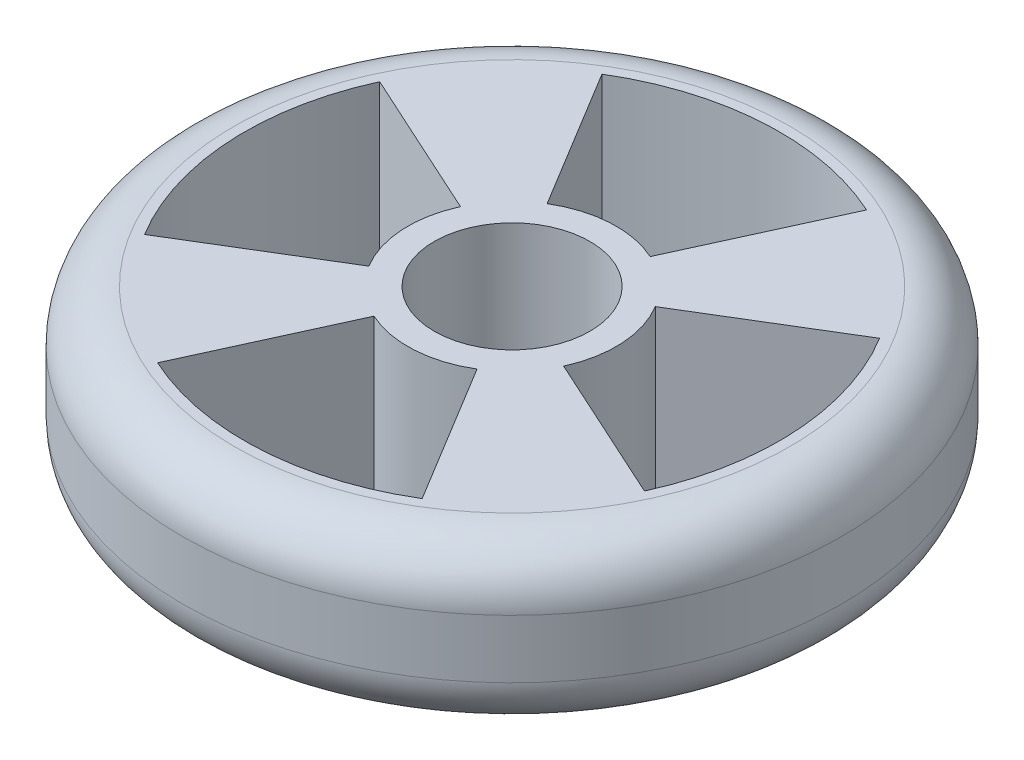
ISO-10303-21;
HEADER;
FILE_DESCRIPTION(('STEP AP214'),'2;1');
FILE_NAME('part.step','',(''),(''),'','','');
FILE_SCHEMA(('AUTOMOTIVE_DESIGN { 1 0 10303 214 1 1 1 1 }'));
ENDSEC;
DATA;
#1=APPLICATION_CONTEXT('core data for automotive mechanical design processes');
#2=APPLICATION_PROTOCOL_DEFINITION('international standard','automotive_design',2000,#1);
#3=PRODUCT_CONTEXT('',#1,'mechanical');
#4=PRODUCT('Part','Part','',(#3));
#5=PRODUCT_RELATED_PRODUCT_CATEGORY('part','',(#4));
#6=PRODUCT_DEFINITION_FORMATION('','',#4);
#7=PRODUCT_DEFINITION_CONTEXT('part definition',#1,'design');
#8=PRODUCT_DEFINITION('design','',#6,#7);
#9=PRODUCT_DEFINITION_SHAPE('','',#8);
#10=(LENGTH_UNIT() NAMED_UNIT(*) SI_UNIT(.MILLI.,.METRE.));
#11=(NAMED_UNIT(*) PLANE_ANGLE_UNIT() SI_UNIT($,.RADIAN.));
#12=(NAMED_UNIT(*) SI_UNIT($,.STERADIAN.) SOLID_ANGLE_UNIT());
#13=UNCERTAINTY_MEASURE_WITH_UNIT(LENGTH_MEASURE(1.E-05),#10,'distance_accuracy_value','');
#14=(GEOMETRIC_REPRESENTATION_CONTEXT(3) GLOBAL_UNCERTAINTY_ASSIGNED_CONTEXT((#13)) GLOBAL_UNIT_ASSIGNED_CONTEXT((#10,
#11,#12)) REPRESENTATION_CONTEXT('',''));
#15=CARTESIAN_POINT('',(0.,0.,0.));
#16=DIRECTION('',(0.,0.,1.));
#17=DIRECTION('',(1.,0.,0.));
#18=AXIS2_PLACEMENT_3D('',#15,#16,#17);
#19=CARTESIAN_POINT('',(0.,25.,-8.));
#20=DIRECTION('',(0.,-1.,0.));
#21=DIRECTION('',(0.,0.,-1.));
#22=AXIS2_PLACEMENT_3D('',#19,#20,#21);
#23=CYLINDRICAL_SURFACE('',#22,1.61);
#24=CARTESIAN_POINT('',(0.,-5.,-8.));
#25=DIRECTION('',(0.,-1.,0.));
#26=DIRECTION('',(0.,0.,1.));
#27=AXIS2_PLACEMENT_3D('',#24,#25,#26);
#28=CIRCLE('',#27,1.61);
#29=CARTESIAN_POINT('',(0.,-5.,-6.39));
#30=VERTEX_POINT('',#29);
#31=EDGE_CURVE('E340',#30,#30,#28,.T.);
#32=ORIENTED_EDGE('',*,*,#31,.T.);
#33=EDGE_LOOP('',(#32));
#34=FACE_BOUND('',#33,.T.);
#35=CARTESIAN_POINT('',(0.,-2.3,-8.));
#36=DIRECTION('',(0.,1.,0.));
#37=DIRECTION('',(0.,0.,1.));
#38=AXIS2_PLACEMENT_3D('',#35,#36,#37);
#39=CIRCLE('',#38,1.61);
#40=CARTESIAN_POINT('',(0.,-2.3,-6.39));
#41=VERTEX_POINT('',#40);
#42=EDGE_CURVE('E43',#41,#41,#39,.F.);
#43=ORIENTED_EDGE('',*,*,#42,.F.);
#44=EDGE_LOOP('',(#43));
#45=FACE_BOUND('',#44,.T.);
#46=ADVANCED_FACE('F39',(#34,#45),#23,.F.);
#47=CARTESIAN_POINT('',(8.,25.,0.));
#48=DIRECTION('',(0.,-1.,0.));
#49=DIRECTION('',(0.,0.,-1.));
#50=AXIS2_PLACEMENT_3D('',#47,#48,#49);
#51=CYLINDRICAL_SURFACE('',#50,1.61);
#52=CARTESIAN_POINT('',(8.,-5.,0.));
#53=DIRECTION('',(0.,-1.,0.));
#54=DIRECTION('',(0.,0.,-1.));
#55=AXIS2_PLACEMENT_3D('',#52,#53,#54);
#56=CIRCLE('',#55,1.61);
#57=CARTESIAN_POINT('',(8.,-5.,-1.61));
#58=VERTEX_POINT('',#57);
#59=EDGE_CURVE('E345',#58,#58,#56,.T.);
#60=ORIENTED_EDGE('',*,*,#59,.T.);
#61=EDGE_LOOP('',(#60));
#62=FACE_BOUND('',#61,.T.);
#63=CARTESIAN_POINT('',(8.,-2.3,0.));
#64=DIRECTION('',(0.,1.,0.));
#65=DIRECTION('',(0.,0.,1.));
#66=AXIS2_PLACEMENT_3D('',#63,#64,#65);
#67=CIRCLE('',#66,1.61);
#68=CARTESIAN_POINT('',(8.,-2.3,1.61));
#69=VERTEX_POINT('',#68);
#70=EDGE_CURVE('E457',#69,#69,#67,.F.);
#71=ORIENTED_EDGE('',*,*,#70,.F.);
#72=EDGE_LOOP('',(#71));
#73=FACE_BOUND('',#72,.T.);
#74=ADVANCED_FACE('F555',(#62,#73),#51,.F.);
#75=CARTESIAN_POINT('',(-8.,25.,0.));
#76=DIRECTION('',(0.,-1.,0.));
#77=DIRECTION('',(0.,0.,-1.));
#78=AXIS2_PLACEMENT_3D('',#75,#76,#77);
#79=CYLINDRICAL_SURFACE('',#78,1.61);
#80=CARTESIAN_POINT('',(-8.,-5.,0.));
#81=DIRECTION('',(0.,-1.,0.));
#82=DIRECTION('',(0.,0.,1.));
#83=AXIS2_PLACEMENT_3D('',#80,#81,#82);
#84=CIRCLE('',#83,1.61);
#85=CARTESIAN_POINT('',(-8.,-5.,1.61));
#86=VERTEX_POINT('',#85);
#87=EDGE_CURVE('E341',#86,#86,#84,.T.);
#88=ORIENTED_EDGE('',*,*,#87,.T.);
#89=EDGE_LOOP('',(#88));
#90=FACE_BOUND('',#89,.T.);
#91=CARTESIAN_POINT('',(-8.,-2.3,0.));
#92=DIRECTION('',(0.,1.,0.));
#93=DIRECTION('',(0.,0.,1.));
#94=AXIS2_PLACEMENT_3D('',#91,#92,#93);
#95=CIRCLE('',#94,1.61);
#96=CARTESIAN_POINT('',(-8.,-2.3,1.61));
#97=VERTEX_POINT('',#96);
#98=EDGE_CURVE('E453',#97,#97,#95,.F.);
#99=ORIENTED_EDGE('',*,*,#98,.F.);
#100=EDGE_LOOP('',(#99));
#101=FACE_BOUND('',#100,.T.);
#102=ADVANCED_FACE('F561',(#90,#101),#79,.F.);
#103=CARTESIAN_POINT('',(0.,25.,8.));
#104=DIRECTION('',(0.,-1.,0.));
#105=DIRECTION('',(0.,0.,-1.));
#106=AXIS2_PLACEMENT_3D('',#103,#104,#105);
#107=CYLINDRICAL_SURFACE('',#106,1.61);
#108=CARTESIAN_POINT('',(0.,-5.,8.));
#109=DIRECTION('',(0.,-1.,0.));
#110=DIRECTION('',(0.,0.,-1.));
#111=AXIS2_PLACEMENT_3D('',#108,#109,#110);
#112=CIRCLE('',#111,1.61);
#113=CARTESIAN_POINT('',(0.,-5.,6.39));
#114=VERTEX_POINT('',#113);
#115=EDGE_CURVE('E335',#114,#114,#112,.T.);
#116=ORIENTED_EDGE('',*,*,#115,.T.);
#117=EDGE_LOOP('',(#116));
#118=FACE_BOUND('',#117,.T.);
#119=CARTESIAN_POINT('',(0.,-2.3,8.));
#120=DIRECTION('',(0.,1.,0.));
#121=DIRECTION('',(0.,0.,1.));
#122=AXIS2_PLACEMENT_3D('',#119,#120,#121);
#123=CIRCLE('',#122,1.61);
#124=CARTESIAN_POINT('',(0.,-2.3,9.61));
#125=VERTEX_POINT('',#124);
#126=EDGE_CURVE('E449',#125,#125,#123,.F.);
#127=ORIENTED_EDGE('',*,*,#126,.F.);
#128=EDGE_LOOP('',(#127));
#129=FACE_BOUND('',#128,.T.);
#130=ADVANCED_FACE('F572',(#118,#129),#107,.F.);
#131=CARTESIAN_POINT('',(0.,25.,0.));
#132=DIRECTION('',(0.,-1.,0.));
#133=DIRECTION('',(0.,0.,-1.));
#134=AXIS2_PLACEMENT_3D('',#131,#132,#133);
#135=CYLINDRICAL_SURFACE('',#134,50.8);
#136=CARTESIAN_POINT('',(0.,8.,0.));
#137=DIRECTION('',(0.,1.,0.));
#138=DIRECTION('',(0.,0.,1.));
#139=AXIS2_PLACEMENT_3D('',#136,#137,#138);
#140=CIRCLE('',#139,50.8);
#141=CARTESIAN_POINT('',(0.,8.,50.8));
#142=VERTEX_POINT('',#141);
#143=EDGE_CURVE('E375',#142,#142,#140,.T.);
#144=ORIENTED_EDGE('',*,*,#143,.T.);
#145=EDGE_LOOP('',(#144));
#146=FACE_BOUND('',#145,.T.);
#147=CARTESIAN_POINT('',(0.,17.,0.));
#148=DIRECTION('',(0.,1.,0.));
#149=DIRECTION('',(0.,0.,1.));
#150=AXIS2_PLACEMENT_3D('',#147,#148,#149);
#151=CIRCLE('',#150,50.8);
#152=CARTESIAN_POINT('',(0.,17.,50.8));
#153=VERTEX_POINT('',#152);
#154=EDGE_CURVE('E371',#153,#153,#151,.F.);
#155=ORIENTED_EDGE('',*,*,#154,.T.);
#156=EDGE_LOOP('',(#155));
#157=FACE_BOUND('',#156,.T.);
#158=ADVANCED_FACE('F535',(#146,#157),#135,.T.);
#159=CARTESIAN_POINT('',(0.,25.,0.));
#160=DIRECTION('',(0.,1.,0.));
#161=DIRECTION('',(0.,0.,1.));
#162=AXIS2_PLACEMENT_3D('',#159,#160,#161);
#163=PLANE('',#162);
#164=CARTESIAN_POINT('',(0.,25.,0.));
#165=DIRECTION('',(0.,-1.,0.));
#166=DIRECTION('',(0.,0.,1.));
#167=AXIS2_PLACEMENT_3D('',#164,#165,#166);
#168=CIRCLE('',#167,16.0687261905688);
#169=CARTESIAN_POINT('',(8.33744290540899,25.,13.7364845279466));
#170=VERTEX_POINT('',#169);
#171=CARTESIAN_POINT('',(-6.66964014308334,25.,14.6191607744509));
#172=VERTEX_POINT('',#171);
#173=EDGE_CURVE('E57',#170,#172,#168,.T.);
#174=ORIENTED_EDGE('',*,*,#173,.F.);
#175=DIRECTION('',(-0.518861470817922,0.,-0.854858335691162));
#176=VECTOR('',#175,1.);
#177=CARTESIAN_POINT('',(8.33744290540899,25.,13.7364845279466));
#178=LINE('',#177,#176);
#179=CARTESIAN_POINT('',(21.4007271001007,25.,35.2591028247552));
#180=VERTEX_POINT('',#179);
#181=EDGE_CURVE('E233',#180,#170,#178,.T.);
#182=ORIENTED_EDGE('',*,*,#181,.F.);
#183=CARTESIAN_POINT('',(0.,25.,0.));
#184=DIRECTION('',(0.,1.,0.));
#185=DIRECTION('',(0.,0.,1.));
#186=AXIS2_PLACEMENT_3D('',#183,#184,#185);
#187=CIRCLE('',#186,41.245550698465);
#188=CARTESIAN_POINT('',(-17.1197752329317,25.,37.5247751278211));
#189=VERTEX_POINT('',#188);
#190=EDGE_CURVE('E229',#189,#180,#187,.T.);
#191=ORIENTED_EDGE('',*,*,#190,.F.);
#192=DIRECTION('',(-0.415069624311474,0.,0.90978964984986));
#193=VECTOR('',#192,1.);
#194=CARTESIAN_POINT('',(-6.66964014308333,25.,14.6191607744509));
#195=LINE('',#194,#193);
#196=EDGE_CURVE('E225',#172,#189,#195,.T.);
#197=ORIENTED_EDGE('',*,*,#196,.F.);
#198=EDGE_LOOP('',(#174,#182,#191,#197));
#199=FACE_BOUND('',#198,.T.);
#200=CARTESIAN_POINT('',(0.,25.,0.));
#201=DIRECTION('',(0.,-1.,0.));
#202=DIRECTION('',(0.,0.,1.));
#203=AXIS2_PLACEMENT_3D('',#200,#201,#202);
#204=CIRCLE('',#203,16.0687261905688);
#205=CARTESIAN_POINT('',(13.7364845279466,25.,-8.33744290540903));
#206=VERTEX_POINT('',#205);
#207=CARTESIAN_POINT('',(14.6191607744509,25.,6.66964014308329));
#208=VERTEX_POINT('',#207);
#209=EDGE_CURVE('E65',#206,#208,#204,.T.);
#210=ORIENTED_EDGE('',*,*,#209,.F.);
#211=DIRECTION('',(-0.85485833569116,0.,0.518861470817925));
#212=VECTOR('',#211,1.);
#213=CARTESIAN_POINT('',(13.7364845279466,25.,-8.33744290540903));
#214=LINE('',#213,#212);
#215=CARTESIAN_POINT('',(35.2591028247551,25.,-21.4007271001008));
#216=VERTEX_POINT('',#215);
#217=EDGE_CURVE('E259',#216,#206,#214,.T.);
#218=ORIENTED_EDGE('',*,*,#217,.F.);
#219=CARTESIAN_POINT('',(0.,25.,0.));
#220=DIRECTION('',(0.,1.,0.));
#221=DIRECTION('',(0.,0.,1.));
#222=AXIS2_PLACEMENT_3D('',#219,#220,#221);
#223=CIRCLE('',#222,41.245550698465);
#224=CARTESIAN_POINT('',(37.5247751278212,25.,17.1197752329316));
#225=VERTEX_POINT('',#224);
#226=EDGE_CURVE('E255',#225,#216,#223,.T.);
#227=ORIENTED_EDGE('',*,*,#226,.F.);
#228=DIRECTION('',(0.909789649849862,0.,0.415069624311471));
#229=VECTOR('',#228,1.);
#230=CARTESIAN_POINT('',(14.6191607744509,25.,6.66964014308329));
#231=LINE('',#230,#229);
#232=EDGE_CURVE('E251',#208,#225,#231,.T.);
#233=ORIENTED_EDGE('',*,*,#232,.F.);
#234=EDGE_LOOP('',(#210,#218,#227,#233));
#235=FACE_BOUND('',#234,.T.);
#236=CARTESIAN_POINT('',(0.,25.,0.));
#237=DIRECTION('',(0.,-1.,0.));
#238=DIRECTION('',(0.,0.,1.));
#239=AXIS2_PLACEMENT_3D('',#236,#237,#238);
#240=CIRCLE('',#239,16.0687261905688);
#241=CARTESIAN_POINT('',(-13.7364845279467,25.,8.33744290540894));
#242=VERTEX_POINT('',#241);
#243=CARTESIAN_POINT('',(-14.6191607744508,25.,-6.66964014308339));
#244=VERTEX_POINT('',#243);
#245=EDGE_CURVE('E204',#242,#244,#240,.T.);
#246=ORIENTED_EDGE('',*,*,#245,.F.);
#247=DIRECTION('',(0.854858335691163,0.,-0.518861470817919));
#248=VECTOR('',#247,1.);
#249=CARTESIAN_POINT('',(-13.7364845279467,25.,8.33744290540894));
#250=LINE('',#249,#248);
#251=CARTESIAN_POINT('',(-35.2591028247553,25.,21.4007271001006));
#252=VERTEX_POINT('',#251);
#253=EDGE_CURVE('E209',#252,#242,#250,.T.);
#254=ORIENTED_EDGE('',*,*,#253,.F.);
#255=CARTESIAN_POINT('',(0.,25.,0.));
#256=DIRECTION('',(0.,1.,0.));
#257=DIRECTION('',(0.,0.,1.));
#258=AXIS2_PLACEMENT_3D('',#255,#256,#257);
#259=CIRCLE('',#258,41.245550698465);
#260=CARTESIAN_POINT('',(-37.5247751278211,25.,-17.1197752329319));
#261=VERTEX_POINT('',#260);
#262=EDGE_CURVE('E186',#261,#252,#259,.T.);
#263=ORIENTED_EDGE('',*,*,#262,.F.);
#264=DIRECTION('',(-0.909789649849859,0.,-0.415069624311477));
#265=VECTOR('',#264,1.);
#266=CARTESIAN_POINT('',(-14.6191607744508,25.,-6.66964014308339));
#267=LINE('',#266,#265);
#268=EDGE_CURVE('E198',#244,#261,#267,.T.);
#269=ORIENTED_EDGE('',*,*,#268,.F.);
#270=EDGE_LOOP('',(#246,#254,#263,#269));
#271=FACE_BOUND('',#270,.T.);
#272=CARTESIAN_POINT('',(0.,25.,0.));
#273=DIRECTION('',(0.,-1.,0.));
#274=DIRECTION('',(0.,0.,1.));
#275=AXIS2_PLACEMENT_3D('',#272,#273,#274);
#276=CIRCLE('',#275,16.0687261905688);
#277=CARTESIAN_POINT('',(-8.33744290540909,25.,-13.7364845279466));
#278=VERTEX_POINT('',#277);
#279=CARTESIAN_POINT('',(6.66964014308323,25.,-14.6191607744509));
#280=VERTEX_POINT('',#279);
#281=EDGE_CURVE('E267',#278,#280,#276,.T.);
#282=ORIENTED_EDGE('',*,*,#281,.F.);
#283=DIRECTION('',(0.518861470817928,0.,0.854858335691158));
#284=VECTOR('',#283,1.);
#285=CARTESIAN_POINT('',(-8.33744290540909,25.,-13.7364845279466));
#286=LINE('',#285,#284);
#287=CARTESIAN_POINT('',(-21.4007271001009,25.,-35.259102824755));
#288=VERTEX_POINT('',#287);
#289=EDGE_CURVE('E286',#288,#278,#286,.T.);
#290=ORIENTED_EDGE('',*,*,#289,.F.);
#291=CARTESIAN_POINT('',(0.,25.,0.));
#292=DIRECTION('',(0.,1.,0.));
#293=DIRECTION('',(0.,0.,1.));
#294=AXIS2_PLACEMENT_3D('',#291,#292,#293);
#295=CIRCLE('',#294,41.245550698465);
#296=CARTESIAN_POINT('',(17.1197752329315,25.,-37.5247751278212));
#297=VERTEX_POINT('',#296);
#298=EDGE_CURVE('E282',#297,#288,#295,.T.);
#299=ORIENTED_EDGE('',*,*,#298,.F.);
#300=DIRECTION('',(0.415069624311468,0.,-0.909789649849864));
#301=VECTOR('',#300,1.);
#302=CARTESIAN_POINT('',(6.66964014308324,25.,-14.6191607744509));
#303=LINE('',#302,#301);
#304=EDGE_CURVE('E278',#280,#297,#303,.T.);
#305=ORIENTED_EDGE('',*,*,#304,.F.);
#306=EDGE_LOOP('',(#282,#290,#299,#305));
#307=FACE_BOUND('',#306,.T.);
#308=CARTESIAN_POINT('',(0.,25.,0.));
#309=DIRECTION('',(0.,1.,0.));
#310=DIRECTION('',(0.,0.,1.));
#311=AXIS2_PLACEMENT_3D('',#308,#309,#310);
#312=CIRCLE('',#311,12.);
#313=CARTESIAN_POINT('',(0.,25.,12.));
#314=VERTEX_POINT('',#313);
#315=EDGE_CURVE('E360',#314,#314,#312,.T.);
#316=ORIENTED_EDGE('',*,*,#315,.F.);
#317=EDGE_LOOP('',(#316));
#318=FACE_BOUND('',#317,.T.);
#319=CARTESIAN_POINT('',(0.,25.,0.));
#320=DIRECTION('',(0.,1.,0.));
#321=DIRECTION('',(0.,0.,1.));
#322=AXIS2_PLACEMENT_3D('',#319,#320,#321);
#323=CIRCLE('',#322,42.8);
#324=CARTESIAN_POINT('',(0.,25.,42.8));
#325=VERTEX_POINT('',#324);
#326=EDGE_CURVE('E367',#325,#325,#323,.T.);
#327=ORIENTED_EDGE('',*,*,#326,.T.);
#328=EDGE_LOOP('',(#327));
#329=FACE_BOUND('',#328,.T.);
#330=ADVANCED_FACE('F206',(#199,#235,#271,#307,#318,#329),#163,.T.);
#331=CARTESIAN_POINT('',(0.,0.,0.));
#332=DIRECTION('',(0.,1.,0.));
#333=DIRECTION('',(0.,0.,1.));
#334=AXIS2_PLACEMENT_3D('',#331,#332,#333);
#335=PLANE('',#334);
#336=CARTESIAN_POINT('',(0.,0.,0.));
#337=DIRECTION('',(0.,1.,0.));
#338=DIRECTION('',(0.,0.,1.));
#339=AXIS2_PLACEMENT_3D('',#336,#337,#338);
#340=CIRCLE('',#339,41.245550698465);
#341=CARTESIAN_POINT('',(-17.1197752329317,0.,37.5247751278211));
#342=VERTEX_POINT('',#341);
#343=CARTESIAN_POINT('',(21.4007271001007,0.,35.2591028247552));
#344=VERTEX_POINT('',#343);
#345=EDGE_CURVE('E11',#342,#344,#340,.T.);
#346=ORIENTED_EDGE('',*,*,#345,.T.);
#347=DIRECTION('',(-0.518861470817922,0.,-0.854858335691162));
#348=VECTOR('',#347,1.);
#349=CARTESIAN_POINT('',(0.,0.,0.));
#350=LINE('',#349,#348);
#351=CARTESIAN_POINT('',(11.6309017171609,0.,19.1626741312013));
#352=VERTEX_POINT('',#351);
#353=EDGE_CURVE('E330',#344,#352,#350,.T.);
#354=ORIENTED_EDGE('',*,*,#353,.T.);
#355=CARTESIAN_POINT('',(0.,0.,0.));
#356=DIRECTION('',(0.,1.,0.));
#357=DIRECTION('',(0.,0.,1.));
#358=AXIS2_PLACEMENT_3D('',#355,#356,#357);
#359=CIRCLE('',#358,22.4161984870957);
#360=CARTESIAN_POINT('',(20.3940253725398,0.,9.30428308453016));
#361=VERTEX_POINT('',#360);
#362=EDGE_CURVE('E384',#352,#361,#359,.T.);
#363=ORIENTED_EDGE('',*,*,#362,.T.);
#364=DIRECTION('',(0.909789649849862,0.,0.415069624311471));
#365=VECTOR('',#364,1.);
#366=CARTESIAN_POINT('',(0.,0.,0.));
#367=LINE('',#366,#365);
#368=CARTESIAN_POINT('',(37.5247751278212,0.,17.1197752329316));
#369=VERTEX_POINT('',#368);
#370=EDGE_CURVE('E318',#361,#369,#367,.T.);
#371=ORIENTED_EDGE('',*,*,#370,.T.);
#372=CARTESIAN_POINT('',(0.,0.,0.));
#373=DIRECTION('',(0.,1.,0.));
#374=DIRECTION('',(0.,0.,1.));
#375=AXIS2_PLACEMENT_3D('',#372,#373,#374);
#376=CIRCLE('',#375,41.245550698465);
#377=CARTESIAN_POINT('',(35.2591028247551,0.,-21.4007271001008));
#378=VERTEX_POINT('',#377);
#379=EDGE_CURVE('E49',#369,#378,#376,.T.);
#380=ORIENTED_EDGE('',*,*,#379,.T.);
#381=DIRECTION('',(-0.85485833569116,0.,0.518861470817925));
#382=VECTOR('',#381,1.);
#383=CARTESIAN_POINT('',(0.,0.,0.));
#384=LINE('',#383,#382);
#385=CARTESIAN_POINT('',(19.1626741312013,0.,-11.630901717161));
#386=VERTEX_POINT('',#385);
#387=EDGE_CURVE('E322',#378,#386,#384,.T.);
#388=ORIENTED_EDGE('',*,*,#387,.T.);
#389=CARTESIAN_POINT('',(9.30428308453009,0.,-20.3940253725398));
#390=VERTEX_POINT('',#389);
#391=EDGE_CURVE('E389',#386,#390,#359,.T.);
#392=ORIENTED_EDGE('',*,*,#391,.T.);
#393=DIRECTION('',(0.415069624311468,0.,-0.909789649849863));
#394=VECTOR('',#393,1.);
#395=CARTESIAN_POINT('',(0.,0.,0.));
#396=LINE('',#395,#394);
#397=CARTESIAN_POINT('',(17.1197752329315,0.,-37.5247751278212));
#398=VERTEX_POINT('',#397);
#399=EDGE_CURVE('E294',#390,#398,#396,.T.);
#400=ORIENTED_EDGE('',*,*,#399,.T.);
#401=CARTESIAN_POINT('',(0.,0.,0.));
#402=DIRECTION('',(0.,1.,0.));
#403=DIRECTION('',(0.,0.,1.));
#404=AXIS2_PLACEMENT_3D('',#401,#402,#403);
#405=CIRCLE('',#404,41.245550698465);
#406=CARTESIAN_POINT('',(-21.4007271001009,0.,-35.259102824755));
#407=VERTEX_POINT('',#406);
#408=EDGE_CURVE('E440',#398,#407,#405,.T.);
#409=ORIENTED_EDGE('',*,*,#408,.T.);
#410=DIRECTION('',(0.518861470817928,0.,0.854858335691158));
#411=VECTOR('',#410,1.);
#412=CARTESIAN_POINT('',(0.,0.,0.));
#413=LINE('',#412,#411);
#414=CARTESIAN_POINT('',(-11.6309017171611,0.,-19.1626741312012));
#415=VERTEX_POINT('',#414);
#416=EDGE_CURVE('E307',#407,#415,#413,.T.);
#417=ORIENTED_EDGE('',*,*,#416,.T.);
#418=CARTESIAN_POINT('',(-20.3940253725397,0.,-9.3042830845303));
#419=VERTEX_POINT('',#418);
#420=EDGE_CURVE('E906',#415,#419,#359,.T.);
#421=ORIENTED_EDGE('',*,*,#420,.T.);
#422=DIRECTION('',(-0.909789649849859,0.,-0.415069624311477));
#423=VECTOR('',#422,1.);
#424=CARTESIAN_POINT('',(0.,0.,0.));
#425=LINE('',#424,#423);
#426=CARTESIAN_POINT('',(-37.5247751278211,0.,-17.1197752329319));
#427=VERTEX_POINT('',#426);
#428=EDGE_CURVE('E311',#419,#427,#425,.T.);
#429=ORIENTED_EDGE('',*,*,#428,.T.);
#430=CARTESIAN_POINT('',(0.,0.,0.));
#431=DIRECTION('',(0.,1.,0.));
#432=DIRECTION('',(0.,0.,1.));
#433=AXIS2_PLACEMENT_3D('',#430,#431,#432);
#434=CIRCLE('',#433,41.245550698465);
#435=CARTESIAN_POINT('',(-35.2591028247553,0.,21.4007271001006));
#436=VERTEX_POINT('',#435);
#437=EDGE_CURVE('E189',#427,#436,#434,.T.);
#438=ORIENTED_EDGE('',*,*,#437,.T.);
#439=DIRECTION('',(0.854858335691163,0.,-0.518861470817919));
#440=VECTOR('',#439,1.);
#441=CARTESIAN_POINT('',(0.,0.,0.));
#442=LINE('',#441,#440);
#443=CARTESIAN_POINT('',(-19.1626741312014,0.,11.6309017171609));
#444=VERTEX_POINT('',#443);
#445=EDGE_CURVE('E314',#436,#444,#442,.T.);
#446=ORIENTED_EDGE('',*,*,#445,.T.);
#447=CARTESIAN_POINT('',(-9.30428308453023,0.,20.3940253725397));
#448=VERTEX_POINT('',#447);
#449=EDGE_CURVE('E383',#444,#448,#359,.T.);
#450=ORIENTED_EDGE('',*,*,#449,.T.);
#451=DIRECTION('',(-0.415069624311474,0.,0.90978964984986));
#452=VECTOR('',#451,1.);
#453=CARTESIAN_POINT('',(0.,0.,0.));
#454=LINE('',#453,#452);
#455=EDGE_CURVE('E326',#448,#342,#454,.T.);
#456=ORIENTED_EDGE('',*,*,#455,.T.);
#457=EDGE_LOOP('',(#346,#354,#363,#371,#380,#388,#392,#400,#409,#417,#421,#429,#438,#446,#450,#456));
#458=FACE_BOUND('',#457,.T.);
#459=CARTESIAN_POINT('',(0.,0.,0.));
#460=DIRECTION('',(0.,1.,0.));
#461=DIRECTION('',(0.,0.,1.));
#462=AXIS2_PLACEMENT_3D('',#459,#460,#461);
#463=CIRCLE('',#462,42.8);
#464=CARTESIAN_POINT('',(0.,0.,42.8));
#465=VERTEX_POINT('',#464);
#466=EDGE_CURVE('E379',#465,#465,#463,.F.);
#467=ORIENTED_EDGE('',*,*,#466,.T.);
#468=EDGE_LOOP('',(#467));
#469=FACE_BOUND('',#468,.T.);
#470=ADVANCED_FACE('F534',(#458,#469),#335,.F.);
#471=CARTESIAN_POINT('',(0.,17.,0.));
#472=DIRECTION('',(0.,1.,0.));
#473=DIRECTION('',(0.,0.,1.));
#474=AXIS2_PLACEMENT_3D('',#471,#472,#473);
#475=TOROIDAL_SURFACE('',#474,42.8,8.);
#476=ORIENTED_EDGE('',*,*,#154,.F.);
#477=EDGE_LOOP('',(#476));
#478=FACE_BOUND('',#477,.T.);
#479=ORIENTED_EDGE('',*,*,#326,.F.);
#480=EDGE_LOOP('',(#479));
#481=FACE_BOUND('',#480,.T.);
#482=ADVANCED_FACE('F540',(#478,#481),#475,.T.);
#483=CARTESIAN_POINT('',(0.,8.,0.));
#484=DIRECTION('',(0.,1.,0.));
#485=DIRECTION('',(0.,0.,1.));
#486=AXIS2_PLACEMENT_3D('',#483,#484,#485);
#487=TOROIDAL_SURFACE('',#486,42.8,8.);
#488=ORIENTED_EDGE('',*,*,#466,.F.);
#489=EDGE_LOOP('',(#488));
#490=FACE_BOUND('',#489,.T.);
#491=ORIENTED_EDGE('',*,*,#143,.F.);
#492=EDGE_LOOP('',(#491));
#493=FACE_BOUND('',#492,.T.);
#494=ADVANCED_FACE('F542',(#490,#493),#487,.T.);
#495=CARTESIAN_POINT('',(0.,-5.,0.));
#496=DIRECTION('',(0.,-1.,0.));
#497=DIRECTION('',(0.,0.,-1.));
#498=AXIS2_PLACEMENT_3D('',#495,#496,#497);
#499=PLANE('',#498);
#500=ORIENTED_EDGE('',*,*,#115,.F.);
#501=EDGE_LOOP('',(#500));
#502=FACE_BOUND('',#501,.T.);
#503=CARTESIAN_POINT('',(0.,-5.,0.));
#504=DIRECTION('',(0.,-1.,0.));
#505=DIRECTION('',(0.,0.,-1.));
#506=AXIS2_PLACEMENT_3D('',#503,#504,#505);
#507=CIRCLE('',#506,4.2);
#508=CARTESIAN_POINT('',(0.,-5.,-4.2));
#509=VERTEX_POINT('',#508);
#510=EDGE_CURVE('E334',#509,#509,#507,.T.);
#511=ORIENTED_EDGE('',*,*,#510,.F.);
#512=EDGE_LOOP('',(#511));
#513=FACE_BOUND('',#512,.T.);
#514=ORIENTED_EDGE('',*,*,#87,.F.);
#515=EDGE_LOOP('',(#514));
#516=FACE_BOUND('',#515,.T.);
#517=ORIENTED_EDGE('',*,*,#59,.F.);
#518=EDGE_LOOP('',(#517));
#519=FACE_BOUND('',#518,.T.);
#520=ORIENTED_EDGE('',*,*,#31,.F.);
#521=EDGE_LOOP('',(#520));
#522=FACE_BOUND('',#521,.T.);
#523=CARTESIAN_POINT('',(0.,-5.,0.));
#524=DIRECTION('',(0.,-1.,0.));
#525=DIRECTION('',(0.,0.,-1.));
#526=AXIS2_PLACEMENT_3D('',#523,#524,#525);
#527=CIRCLE('',#526,15.);
#528=CARTESIAN_POINT('',(0.,-5.,-15.));
#529=VERTEX_POINT('',#528);
#530=EDGE_CURVE('E359',#529,#529,#527,.T.);
#531=ORIENTED_EDGE('',*,*,#530,.T.);
#532=EDGE_LOOP('',(#531));
#533=FACE_BOUND('',#532,.T.);
#534=ADVANCED_FACE('F528',(#502,#513,#516,#519,#522,#533),#499,.T.);
#535=CARTESIAN_POINT('',(0.,0.,0.));
#536=DIRECTION('',(0.,1.,0.));
#537=DIRECTION('',(0.,0.,1.));
#538=AXIS2_PLACEMENT_3D('',#535,#536,#537);
#539=CYLINDRICAL_SURFACE('',#538,12.);
#540=CARTESIAN_POINT('',(0.,0.,0.));
#541=DIRECTION('',(0.,1.,0.));
#542=DIRECTION('',(0.,0.,1.));
#543=AXIS2_PLACEMENT_3D('',#540,#541,#542);
#544=CIRCLE('',#543,12.);
#545=CARTESIAN_POINT('',(0.,0.,12.));
#546=VERTEX_POINT('',#545);
#547=EDGE_CURVE('E355',#546,#546,#544,.T.);
#548=ORIENTED_EDGE('',*,*,#547,.F.);
#549=EDGE_LOOP('',(#548));
#550=FACE_BOUND('',#549,.T.);
#551=ORIENTED_EDGE('',*,*,#315,.T.);
#552=EDGE_LOOP('',(#551));
#553=FACE_BOUND('',#552,.T.);
#554=ADVANCED_FACE('F514',(#550,#553),#539,.F.);
#555=CARTESIAN_POINT('',(0.,0.,0.));
#556=DIRECTION('',(0.,1.,0.));
#557=DIRECTION('',(0.,0.,1.));
#558=AXIS2_PLACEMENT_3D('',#555,#556,#557);
#559=PLANE('',#558);
#560=CARTESIAN_POINT('',(-8.,0.,0.));
#561=DIRECTION('',(0.,1.,0.));
#562=DIRECTION('',(0.,0.,1.));
#563=AXIS2_PLACEMENT_3D('',#560,#561,#562);
#564=CIRCLE('',#563,3.4);
#565=CARTESIAN_POINT('',(-8.,0.,3.4));
#566=VERTEX_POINT('',#565);
#567=EDGE_CURVE('E493',#566,#566,#564,.T.);
#568=ORIENTED_EDGE('',*,*,#567,.F.);
#569=EDGE_LOOP('',(#568));
#570=FACE_BOUND('',#569,.T.);
#571=CARTESIAN_POINT('',(0.,0.,-8.));
#572=DIRECTION('',(0.,1.,0.));
#573=DIRECTION('',(0.,0.,1.));
#574=AXIS2_PLACEMENT_3D('',#571,#572,#573);
#575=CIRCLE('',#574,3.4);
#576=CARTESIAN_POINT('',(0.,0.,-4.6));
#577=VERTEX_POINT('',#576);
#578=EDGE_CURVE('E485',#577,#577,#575,.T.);
#579=ORIENTED_EDGE('',*,*,#578,.F.);
#580=EDGE_LOOP('',(#579));
#581=FACE_BOUND('',#580,.T.);
#582=CARTESIAN_POINT('',(8.,0.,0.));
#583=DIRECTION('',(0.,1.,0.));
#584=DIRECTION('',(0.,0.,1.));
#585=AXIS2_PLACEMENT_3D('',#582,#583,#584);
#586=CIRCLE('',#585,3.4);
#587=CARTESIAN_POINT('',(8.,0.,3.4));
#588=VERTEX_POINT('',#587);
#589=EDGE_CURVE('E477',#588,#588,#586,.T.);
#590=ORIENTED_EDGE('',*,*,#589,.F.);
#591=EDGE_LOOP('',(#590));
#592=FACE_BOUND('',#591,.T.);
#593=CARTESIAN_POINT('',(0.,0.,8.));
#594=DIRECTION('',(0.,1.,0.));
#595=DIRECTION('',(0.,0.,1.));
#596=AXIS2_PLACEMENT_3D('',#593,#594,#595);
#597=CIRCLE('',#596,3.4);
#598=CARTESIAN_POINT('',(0.,0.,11.4));
#599=VERTEX_POINT('',#598);
#600=EDGE_CURVE('E469',#599,#599,#597,.T.);
#601=ORIENTED_EDGE('',*,*,#600,.F.);
#602=EDGE_LOOP('',(#601));
#603=FACE_BOUND('',#602,.T.);
#604=CARTESIAN_POINT('',(0.,0.,0.));
#605=DIRECTION('',(0.,1.,0.));
#606=DIRECTION('',(0.,0.,1.));
#607=AXIS2_PLACEMENT_3D('',#604,#605,#606);
#608=CIRCLE('',#607,4.2);
#609=CARTESIAN_POINT('',(0.,0.,4.2));
#610=VERTEX_POINT('',#609);
#611=EDGE_CURVE('E339',#610,#610,#608,.T.);
#612=ORIENTED_EDGE('',*,*,#611,.F.);
#613=EDGE_LOOP('',(#612));
#614=FACE_BOUND('',#613,.T.);
#615=ORIENTED_EDGE('',*,*,#547,.T.);
#616=EDGE_LOOP('',(#615));
#617=FACE_BOUND('',#616,.T.);
#618=ADVANCED_FACE('F511',(#570,#581,#592,#603,#614,#617),#559,.T.);
#619=CARTESIAN_POINT('',(0.,-8.,0.));
#620=DIRECTION('',(0.,1.,0.));
#621=DIRECTION('',(0.,0.,1.));
#622=AXIS2_PLACEMENT_3D('',#619,#620,#621);
#623=TOROIDAL_SURFACE('',#622,22.4161984870957,8.);
#624=ORIENTED_EDGE('',*,*,#362,.F.);
#625=CARTESIAN_POINT('',(11.6309017171609,-8.,19.1626741312013));
#626=DIRECTION('',(0.854858335691162,0.,-0.518861470817922));
#627=DIRECTION('',(-0.518861470817922,0.,-0.854858335691162));
#628=AXIS2_PLACEMENT_3D('',#625,#626,#627);
#629=CIRCLE('',#628,8.);
#630=CARTESIAN_POINT('',(8.33744290540899,-3.13075001208359,13.7364845279466));
#631=VERTEX_POINT('',#630);
#632=EDGE_CURVE('E436',#352,#631,#629,.F.);
#633=ORIENTED_EDGE('',*,*,#632,.T.);
#634=CARTESIAN_POINT('',(0.,-3.13075001208359,0.));
#635=DIRECTION('',(0.,-1.,0.));
#636=DIRECTION('',(0.,0.,-1.));
#637=AXIS2_PLACEMENT_3D('',#634,#635,#636);
#638=CIRCLE('',#637,16.0687261905688);
#639=CARTESIAN_POINT('',(-6.66964014308334,-3.13075001208359,14.6191607744509));
#640=VERTEX_POINT('',#639);
#641=EDGE_CURVE('E432',#631,#640,#638,.T.);
#642=ORIENTED_EDGE('',*,*,#641,.T.);
#643=CARTESIAN_POINT('',(-9.30428308453023,-8.,20.3940253725397));
#644=DIRECTION('',(-0.90978964984986,0.,-0.415069624311474));
#645=DIRECTION('',(-0.415069624311474,0.,0.90978964984986));
#646=AXIS2_PLACEMENT_3D('',#643,#644,#645);
#647=CIRCLE('',#646,8.);
#648=EDGE_CURVE('E428',#640,#448,#647,.F.);
#649=ORIENTED_EDGE('',*,*,#648,.T.);
#650=ORIENTED_EDGE('',*,*,#449,.F.);
#651=CARTESIAN_POINT('',(-19.1626741312014,-8.,11.6309017171609));
#652=DIRECTION('',(0.518861470817919,0.,0.854858335691163));
#653=DIRECTION('',(0.854858335691163,0.,-0.518861470817919));
#654=AXIS2_PLACEMENT_3D('',#651,#652,#653);
#655=CIRCLE('',#654,8.);
#656=CARTESIAN_POINT('',(-13.7364845279466,-3.13075001208359,8.33744290540894));
#657=VERTEX_POINT('',#656);
#658=EDGE_CURVE('E412',#444,#657,#655,.F.);
#659=ORIENTED_EDGE('',*,*,#658,.T.);
#660=CARTESIAN_POINT('',(0.,-3.13075001208359,0.));
#661=DIRECTION('',(0.,-1.,0.));
#662=DIRECTION('',(0.,0.,-1.));
#663=AXIS2_PLACEMENT_3D('',#660,#661,#662);
#664=CIRCLE('',#663,16.0687261905688);
#665=CARTESIAN_POINT('',(-14.6191607744508,-3.13075001208359,-6.66964014308339));
#666=VERTEX_POINT('',#665);
#667=EDGE_CURVE('E408',#657,#666,#664,.T.);
#668=ORIENTED_EDGE('',*,*,#667,.T.);
#669=CARTESIAN_POINT('',(-20.3940253725397,-8.,-9.3042830845303));
#670=DIRECTION('',(0.415069624311477,0.,-0.909789649849859));
#671=DIRECTION('',(-0.909789649849859,0.,-0.415069624311477));
#672=AXIS2_PLACEMENT_3D('',#669,#670,#671);
#673=CIRCLE('',#672,8.);
#674=EDGE_CURVE('E404',#666,#419,#673,.F.);
#675=ORIENTED_EDGE('',*,*,#674,.T.);
#676=ORIENTED_EDGE('',*,*,#420,.F.);
#677=CARTESIAN_POINT('',(-11.6309017171611,-8.,-19.1626741312012));
#678=DIRECTION('',(-0.854858335691158,0.,0.518861470817928));
#679=DIRECTION('',(0.518861470817928,0.,0.854858335691158));
#680=AXIS2_PLACEMENT_3D('',#677,#678,#679);
#681=CIRCLE('',#680,8.);
#682=CARTESIAN_POINT('',(-8.33744290540909,-3.13075001208359,-13.7364845279466));
#683=VERTEX_POINT('',#682);
#684=EDGE_CURVE('E400',#415,#683,#681,.F.);
#685=ORIENTED_EDGE('',*,*,#684,.T.);
#686=CARTESIAN_POINT('',(0.,-3.13075001208359,0.));
#687=DIRECTION('',(0.,-1.,0.));
#688=DIRECTION('',(0.,0.,-1.));
#689=AXIS2_PLACEMENT_3D('',#686,#687,#688);
#690=CIRCLE('',#689,16.0687261905688);
#691=CARTESIAN_POINT('',(6.66964014308323,-3.13075001208359,-14.6191607744509));
#692=VERTEX_POINT('',#691);
#693=EDGE_CURVE('E396',#683,#692,#690,.T.);
#694=ORIENTED_EDGE('',*,*,#693,.T.);
#695=CARTESIAN_POINT('',(9.30428308453009,-8.,-20.3940253725398));
#696=DIRECTION('',(0.909789649849863,0.,0.415069624311468));
#697=DIRECTION('',(0.415069624311468,0.,-0.909789649849863));
#698=AXIS2_PLACEMENT_3D('',#695,#696,#697);
#699=CIRCLE('',#698,8.);
#700=EDGE_CURVE('E388',#692,#390,#699,.F.);
#701=ORIENTED_EDGE('',*,*,#700,.T.);
#702=ORIENTED_EDGE('',*,*,#391,.F.);
#703=CARTESIAN_POINT('',(19.1626741312013,-8.,-11.630901717161));
#704=DIRECTION('',(-0.518861470817925,0.,-0.85485833569116));
#705=DIRECTION('',(-0.85485833569116,0.,0.518861470817925));
#706=AXIS2_PLACEMENT_3D('',#703,#704,#705);
#707=CIRCLE('',#706,8.);
#708=CARTESIAN_POINT('',(13.7364845279466,-3.13075001208359,-8.33744290540904));
#709=VERTEX_POINT('',#708);
#710=EDGE_CURVE('E424',#386,#709,#707,.F.);
#711=ORIENTED_EDGE('',*,*,#710,.T.);
#712=CARTESIAN_POINT('',(0.,-3.13075001208359,0.));
#713=DIRECTION('',(0.,-1.,0.));
#714=DIRECTION('',(0.,0.,-1.));
#715=AXIS2_PLACEMENT_3D('',#712,#713,#714);
#716=CIRCLE('',#715,16.0687261905688);
#717=CARTESIAN_POINT('',(14.6191607744509,-3.13075001208359,6.66964014308328));
#718=VERTEX_POINT('',#717);
#719=EDGE_CURVE('E420',#709,#718,#716,.T.);
#720=ORIENTED_EDGE('',*,*,#719,.T.);
#721=CARTESIAN_POINT('',(20.3940253725398,-8.,9.30428308453016));
#722=DIRECTION('',(-0.415069624311471,0.,0.909789649849862));
#723=DIRECTION('',(0.909789649849862,0.,0.415069624311471));
#724=AXIS2_PLACEMENT_3D('',#721,#722,#723);
#725=CIRCLE('',#724,8.);
#726=EDGE_CURVE('E416',#718,#361,#725,.F.);
#727=ORIENTED_EDGE('',*,*,#726,.T.);
#728=EDGE_LOOP('',(#624,#633,#642,#649,#650,#659,#668,#675,#676,#685,#694,#701,#702,#711,#720,#727));
#729=FACE_BOUND('',#728,.T.);
#730=ORIENTED_EDGE('',*,*,#530,.F.);
#731=EDGE_LOOP('',(#730));
#732=FACE_BOUND('',#731,.T.);
#733=ADVANCED_FACE('F41',(#729,#732),#623,.F.);
#734=CARTESIAN_POINT('',(0.,25.,0.));
#735=DIRECTION('',(0.,-1.,0.));
#736=DIRECTION('',(0.,0.,-1.));
#737=AXIS2_PLACEMENT_3D('',#734,#735,#736);
#738=CYLINDRICAL_SURFACE('',#737,4.2);
#739=ORIENTED_EDGE('',*,*,#611,.T.);
#740=EDGE_LOOP('',(#739));
#741=FACE_BOUND('',#740,.T.);
#742=ORIENTED_EDGE('',*,*,#510,.T.);
#743=EDGE_LOOP('',(#742));
#744=FACE_BOUND('',#743,.T.);
#745=ADVANCED_FACE('F566',(#741,#744),#738,.F.);
#746=CARTESIAN_POINT('',(0.,-5.,0.));
#747=DIRECTION('',(0.,1.,0.));
#748=DIRECTION('',(0.,0.,1.));
#749=AXIS2_PLACEMENT_3D('',#746,#747,#748);
#750=CYLINDRICAL_SURFACE('',#749,41.245550698465);
#751=DIRECTION('',(0.,1.,0.));
#752=VECTOR('',#751,1.);
#753=CARTESIAN_POINT('',(17.1197752329315,-5.,-37.5247751278212));
#754=LINE('',#753,#752);
#755=EDGE_CURVE('E298',#398,#297,#754,.T.);
#756=ORIENTED_EDGE('',*,*,#755,.T.);
#757=ORIENTED_EDGE('',*,*,#298,.T.);
#758=DIRECTION('',(0.,1.,0.));
#759=VECTOR('',#758,1.);
#760=CARTESIAN_POINT('',(-21.4007271001009,-5.,-35.259102824755));
#761=LINE('',#760,#759);
#762=EDGE_CURVE('E295',#407,#288,#761,.T.);
#763=ORIENTED_EDGE('',*,*,#762,.F.);
#764=ORIENTED_EDGE('',*,*,#408,.F.);
#765=EDGE_LOOP('',(#756,#757,#763,#764));
#766=FACE_BOUND('',#765,.T.);
#767=ADVANCED_FACE('F592',(#766),#750,.F.);
#768=CARTESIAN_POINT('',(0.,-5.,0.));
#769=DIRECTION('',(0.,1.,0.));
#770=DIRECTION('',(0.,0.,1.));
#771=AXIS2_PLACEMENT_3D('',#768,#769,#770);
#772=CYLINDRICAL_SURFACE('',#771,16.0687261905688);
#773=DIRECTION('',(0.,1.,0.));
#774=VECTOR('',#773,1.);
#775=CARTESIAN_POINT('',(-8.33744290540909,-5.,-13.7364845279466));
#776=LINE('',#775,#774);
#777=EDGE_CURVE('E291',#683,#278,#776,.T.);
#778=ORIENTED_EDGE('',*,*,#777,.T.);
#779=ORIENTED_EDGE('',*,*,#281,.T.);
#780=DIRECTION('',(0.,1.,0.));
#781=VECTOR('',#780,1.);
#782=CARTESIAN_POINT('',(6.66964014308324,-5.,-14.6191607744509));
#783=LINE('',#782,#781);
#784=EDGE_CURVE('E290',#692,#280,#783,.T.);
#785=ORIENTED_EDGE('',*,*,#784,.F.);
#786=ORIENTED_EDGE('',*,*,#693,.F.);
#787=EDGE_LOOP('',(#778,#779,#785,#786));
#788=FACE_BOUND('',#787,.T.);
#789=ADVANCED_FACE('F588',(#788),#772,.T.);
#790=CARTESIAN_POINT('',(-8.33744290540909,-5.,-13.7364845279466));
#791=DIRECTION('',(-0.854858335691158,0.,0.518861470817928));
#792=DIRECTION('',(0.518861470817928,0.,0.854858335691158));
#793=AXIS2_PLACEMENT_3D('',#790,#791,#792);
#794=PLANE('',#793);
#795=ORIENTED_EDGE('',*,*,#762,.T.);
#796=ORIENTED_EDGE('',*,*,#289,.T.);
#797=ORIENTED_EDGE('',*,*,#777,.F.);
#798=ORIENTED_EDGE('',*,*,#684,.F.);
#799=ORIENTED_EDGE('',*,*,#416,.F.);
#800=EDGE_LOOP('',(#795,#796,#797,#798,#799));
#801=FACE_BOUND('',#800,.T.);
#802=ADVANCED_FACE('F591',(#801),#794,.F.);
#803=CARTESIAN_POINT('',(6.66964014308324,-5.,-14.6191607744509));
#804=DIRECTION('',(0.909789649849863,0.,0.415069624311468));
#805=DIRECTION('',(0.415069624311468,0.,-0.909789649849863));
#806=AXIS2_PLACEMENT_3D('',#803,#804,#805);
#807=PLANE('',#806);
#808=ORIENTED_EDGE('',*,*,#700,.F.);
#809=ORIENTED_EDGE('',*,*,#784,.T.);
#810=ORIENTED_EDGE('',*,*,#304,.T.);
#811=ORIENTED_EDGE('',*,*,#755,.F.);
#812=ORIENTED_EDGE('',*,*,#399,.F.);
#813=EDGE_LOOP('',(#808,#809,#810,#811,#812));
#814=FACE_BOUND('',#813,.T.);
#815=ADVANCED_FACE('F594',(#814),#807,.F.);
#816=CARTESIAN_POINT('',(0.,-5.,0.));
#817=DIRECTION('',(0.,1.,0.));
#818=DIRECTION('',(0.,0.,1.));
#819=AXIS2_PLACEMENT_3D('',#816,#817,#818);
#820=CYLINDRICAL_SURFACE('',#819,41.245550698465);
#821=DIRECTION('',(0.,1.,0.));
#822=VECTOR('',#821,1.);
#823=CARTESIAN_POINT('',(-37.5247751278211,-5.,-17.1197752329319));
#824=LINE('',#823,#822);
#825=EDGE_CURVE('E181',#427,#261,#824,.T.);
#826=ORIENTED_EDGE('',*,*,#825,.T.);
#827=ORIENTED_EDGE('',*,*,#262,.T.);
#828=DIRECTION('',(0.,1.,0.));
#829=VECTOR('',#828,1.);
#830=CARTESIAN_POINT('',(-35.2591028247553,-5.,21.4007271001006));
#831=LINE('',#830,#829);
#832=EDGE_CURVE('E193',#436,#252,#831,.T.);
#833=ORIENTED_EDGE('',*,*,#832,.F.);
#834=ORIENTED_EDGE('',*,*,#437,.F.);
#835=EDGE_LOOP('',(#826,#827,#833,#834));
#836=FACE_BOUND('',#835,.T.);
#837=ADVANCED_FACE('F183',(#836),#820,.F.);
#838=CARTESIAN_POINT('',(0.,-5.,0.));
#839=DIRECTION('',(0.,1.,0.));
#840=DIRECTION('',(0.,0.,1.));
#841=AXIS2_PLACEMENT_3D('',#838,#839,#840);
#842=CYLINDRICAL_SURFACE('',#841,16.0687261905688);
#843=DIRECTION('',(0.,1.,0.));
#844=VECTOR('',#843,1.);
#845=CARTESIAN_POINT('',(-13.7364845279467,-5.,8.33744290540894));
#846=LINE('',#845,#844);
#847=EDGE_CURVE('E216',#657,#242,#846,.T.);
#848=ORIENTED_EDGE('',*,*,#847,.T.);
#849=ORIENTED_EDGE('',*,*,#245,.T.);
#850=DIRECTION('',(0.,1.,0.));
#851=VECTOR('',#850,1.);
#852=CARTESIAN_POINT('',(-14.6191607744508,-5.,-6.66964014308339));
#853=LINE('',#852,#851);
#854=EDGE_CURVE('E194',#666,#244,#853,.T.);
#855=ORIENTED_EDGE('',*,*,#854,.F.);
#856=ORIENTED_EDGE('',*,*,#667,.F.);
#857=EDGE_LOOP('',(#848,#849,#855,#856));
#858=FACE_BOUND('',#857,.T.);
#859=ADVANCED_FACE('F635',(#858),#842,.T.);
#860=CARTESIAN_POINT('',(-13.7364845279467,-5.,8.33744290540894));
#861=DIRECTION('',(0.518861470817919,0.,0.854858335691163));
#862=DIRECTION('',(0.854858335691163,0.,-0.518861470817919));
#863=AXIS2_PLACEMENT_3D('',#860,#861,#862);
#864=PLANE('',#863);
#865=ORIENTED_EDGE('',*,*,#832,.T.);
#866=ORIENTED_EDGE('',*,*,#253,.T.);
#867=ORIENTED_EDGE('',*,*,#847,.F.);
#868=ORIENTED_EDGE('',*,*,#658,.F.);
#869=ORIENTED_EDGE('',*,*,#445,.F.);
#870=EDGE_LOOP('',(#865,#866,#867,#868,#869));
#871=FACE_BOUND('',#870,.T.);
#872=ADVANCED_FACE('F638',(#871),#864,.F.);
#873=CARTESIAN_POINT('',(-14.6191607744508,-5.,-6.66964014308339));
#874=DIRECTION('',(0.415069624311477,0.,-0.909789649849859));
#875=DIRECTION('',(-0.909789649849859,0.,-0.415069624311477));
#876=AXIS2_PLACEMENT_3D('',#873,#874,#875);
#877=PLANE('',#876);
#878=ORIENTED_EDGE('',*,*,#674,.F.);
#879=ORIENTED_EDGE('',*,*,#854,.T.);
#880=ORIENTED_EDGE('',*,*,#268,.T.);
#881=ORIENTED_EDGE('',*,*,#825,.F.);
#882=ORIENTED_EDGE('',*,*,#428,.F.);
#883=EDGE_LOOP('',(#878,#879,#880,#881,#882));
#884=FACE_BOUND('',#883,.T.);
#885=ADVANCED_FACE('F199',(#884),#877,.F.);
#886=CARTESIAN_POINT('',(0.,-5.,0.));
#887=DIRECTION('',(0.,1.,0.));
#888=DIRECTION('',(0.,0.,1.));
#889=AXIS2_PLACEMENT_3D('',#886,#887,#888);
#890=CYLINDRICAL_SURFACE('',#889,41.245550698465);
#891=DIRECTION('',(0.,1.,0.));
#892=VECTOR('',#891,1.);
#893=CARTESIAN_POINT('',(37.5247751278212,-5.,17.1197752329316));
#894=LINE('',#893,#892);
#895=EDGE_CURVE('E271',#369,#225,#894,.T.);
#896=ORIENTED_EDGE('',*,*,#895,.T.);
#897=ORIENTED_EDGE('',*,*,#226,.T.);
#898=DIRECTION('',(0.,1.,0.));
#899=VECTOR('',#898,1.);
#900=CARTESIAN_POINT('',(35.2591028247551,-5.,-21.4007271001008));
#901=LINE('',#900,#899);
#902=EDGE_CURVE('E268',#378,#216,#901,.T.);
#903=ORIENTED_EDGE('',*,*,#902,.F.);
#904=ORIENTED_EDGE('',*,*,#379,.F.);
#905=EDGE_LOOP('',(#896,#897,#903,#904));
#906=FACE_BOUND('',#905,.T.);
#907=ADVANCED_FACE('F608',(#906),#890,.F.);
#908=CARTESIAN_POINT('',(0.,-5.,0.));
#909=DIRECTION('',(0.,1.,0.));
#910=DIRECTION('',(0.,0.,1.));
#911=AXIS2_PLACEMENT_3D('',#908,#909,#910);
#912=CYLINDRICAL_SURFACE('',#911,16.0687261905688);
#913=DIRECTION('',(0.,1.,0.));
#914=VECTOR('',#913,1.);
#915=CARTESIAN_POINT('',(13.7364845279466,-5.,-8.33744290540903));
#916=LINE('',#915,#914);
#917=EDGE_CURVE('E264',#709,#206,#916,.T.);
#918=ORIENTED_EDGE('',*,*,#917,.T.);
#919=ORIENTED_EDGE('',*,*,#209,.T.);
#920=DIRECTION('',(0.,1.,0.));
#921=VECTOR('',#920,1.);
#922=CARTESIAN_POINT('',(14.6191607744509,-5.,6.66964014308329));
#923=LINE('',#922,#921);
#924=EDGE_CURVE('E263',#718,#208,#923,.T.);
#925=ORIENTED_EDGE('',*,*,#924,.F.);
#926=ORIENTED_EDGE('',*,*,#719,.F.);
#927=EDGE_LOOP('',(#918,#919,#925,#926));
#928=FACE_BOUND('',#927,.T.);
#929=ADVANCED_FACE('F604',(#928),#912,.T.);
#930=CARTESIAN_POINT('',(13.7364845279466,-5.,-8.33744290540903));
#931=DIRECTION('',(-0.518861470817925,0.,-0.85485833569116));
#932=DIRECTION('',(-0.85485833569116,0.,0.518861470817925));
#933=AXIS2_PLACEMENT_3D('',#930,#931,#932);
#934=PLANE('',#933);
#935=ORIENTED_EDGE('',*,*,#902,.T.);
#936=ORIENTED_EDGE('',*,*,#217,.T.);
#937=ORIENTED_EDGE('',*,*,#917,.F.);
#938=ORIENTED_EDGE('',*,*,#710,.F.);
#939=ORIENTED_EDGE('',*,*,#387,.F.);
#940=EDGE_LOOP('',(#935,#936,#937,#938,#939));
#941=FACE_BOUND('',#940,.T.);
#942=ADVANCED_FACE('F607',(#941),#934,.F.);
#943=CARTESIAN_POINT('',(14.6191607744509,-5.,6.66964014308329));
#944=DIRECTION('',(-0.415069624311471,0.,0.909789649849862));
#945=DIRECTION('',(0.909789649849862,0.,0.415069624311471));
#946=AXIS2_PLACEMENT_3D('',#943,#944,#945);
#947=PLANE('',#946);
#948=ORIENTED_EDGE('',*,*,#726,.F.);
#949=ORIENTED_EDGE('',*,*,#924,.T.);
#950=ORIENTED_EDGE('',*,*,#232,.T.);
#951=ORIENTED_EDGE('',*,*,#895,.F.);
#952=ORIENTED_EDGE('',*,*,#370,.F.);
#953=EDGE_LOOP('',(#948,#949,#950,#951,#952));
#954=FACE_BOUND('',#953,.T.);
#955=ADVANCED_FACE('F609',(#954),#947,.F.);
#956=CARTESIAN_POINT('',(0.,-5.,0.));
#957=DIRECTION('',(0.,1.,0.));
#958=DIRECTION('',(0.,0.,1.));
#959=AXIS2_PLACEMENT_3D('',#956,#957,#958);
#960=CYLINDRICAL_SURFACE('',#959,41.245550698465);
#961=DIRECTION('',(0.,1.,0.));
#962=VECTOR('',#961,1.);
#963=CARTESIAN_POINT('',(-17.1197752329317,-5.,37.5247751278211));
#964=LINE('',#963,#962);
#965=EDGE_CURVE('E244',#342,#189,#964,.T.);
#966=ORIENTED_EDGE('',*,*,#965,.T.);
#967=ORIENTED_EDGE('',*,*,#190,.T.);
#968=DIRECTION('',(0.,1.,0.));
#969=VECTOR('',#968,1.);
#970=CARTESIAN_POINT('',(21.4007271001007,-5.,35.2591028247552));
#971=LINE('',#970,#969);
#972=EDGE_CURVE('E241',#344,#180,#971,.T.);
#973=ORIENTED_EDGE('',*,*,#972,.F.);
#974=ORIENTED_EDGE('',*,*,#345,.F.);
#975=EDGE_LOOP('',(#966,#967,#973,#974));
#976=FACE_BOUND('',#975,.T.);
#977=ADVANCED_FACE('F612',(#976),#960,.F.);
#978=CARTESIAN_POINT('',(0.,-5.,0.));
#979=DIRECTION('',(0.,1.,0.));
#980=DIRECTION('',(0.,0.,1.));
#981=AXIS2_PLACEMENT_3D('',#978,#979,#980);
#982=CYLINDRICAL_SURFACE('',#981,16.0687261905688);
#983=DIRECTION('',(0.,1.,0.));
#984=VECTOR('',#983,1.);
#985=CARTESIAN_POINT('',(8.33744290540899,-5.,13.7364845279466));
#986=LINE('',#985,#984);
#987=EDGE_CURVE('E238',#631,#170,#986,.T.);
#988=ORIENTED_EDGE('',*,*,#987,.T.);
#989=ORIENTED_EDGE('',*,*,#173,.T.);
#990=DIRECTION('',(0.,1.,0.));
#991=VECTOR('',#990,1.);
#992=CARTESIAN_POINT('',(-6.66964014308333,-5.,14.6191607744509));
#993=LINE('',#992,#991);
#994=EDGE_CURVE('E237',#640,#172,#993,.T.);
#995=ORIENTED_EDGE('',*,*,#994,.F.);
#996=ORIENTED_EDGE('',*,*,#641,.F.);
#997=EDGE_LOOP('',(#988,#989,#995,#996));
#998=FACE_BOUND('',#997,.T.);
#999=ADVANCED_FACE('F620',(#998),#982,.T.);
#1000=CARTESIAN_POINT('',(8.33744290540899,-5.,13.7364845279466));
#1001=DIRECTION('',(0.854858335691162,0.,-0.518861470817922));
#1002=DIRECTION('',(-0.518861470817922,0.,-0.854858335691162));
#1003=AXIS2_PLACEMENT_3D('',#1000,#1001,#1002);
#1004=PLANE('',#1003);
#1005=ORIENTED_EDGE('',*,*,#972,.T.);
#1006=ORIENTED_EDGE('',*,*,#181,.T.);
#1007=ORIENTED_EDGE('',*,*,#987,.F.);
#1008=ORIENTED_EDGE('',*,*,#632,.F.);
#1009=ORIENTED_EDGE('',*,*,#353,.F.);
#1010=EDGE_LOOP('',(#1005,#1006,#1007,#1008,#1009));
#1011=FACE_BOUND('',#1010,.T.);
#1012=ADVANCED_FACE('F623',(#1011),#1004,.F.);
#1013=CARTESIAN_POINT('',(-6.66964014308333,-5.,14.6191607744509));
#1014=DIRECTION('',(-0.90978964984986,0.,-0.415069624311474));
#1015=DIRECTION('',(-0.415069624311474,0.,0.90978964984986));
#1016=AXIS2_PLACEMENT_3D('',#1013,#1014,#1015);
#1017=PLANE('',#1016);
#1018=ORIENTED_EDGE('',*,*,#648,.F.);
#1019=ORIENTED_EDGE('',*,*,#994,.T.);
#1020=ORIENTED_EDGE('',*,*,#196,.T.);
#1021=ORIENTED_EDGE('',*,*,#965,.F.);
#1022=ORIENTED_EDGE('',*,*,#455,.F.);
#1023=EDGE_LOOP('',(#1018,#1019,#1020,#1021,#1022));
#1024=FACE_BOUND('',#1023,.T.);
#1025=ADVANCED_FACE('F624',(#1024),#1017,.F.);
#1026=CARTESIAN_POINT('',(0.,-2.3,8.));
#1027=DIRECTION('',(0.,1.,0.));
#1028=DIRECTION('',(0.,0.,1.));
#1029=AXIS2_PLACEMENT_3D('',#1026,#1027,#1028);
#1030=PLANE('',#1029);
#1031=CARTESIAN_POINT('',(0.,-2.3,8.));
#1032=DIRECTION('',(0.,1.,0.));
#1033=DIRECTION('',(0.,0.,1.));
#1034=AXIS2_PLACEMENT_3D('',#1031,#1032,#1033);
#1035=CIRCLE('',#1034,3.4);
#1036=CARTESIAN_POINT('',(0.,-2.3,11.4));
#1037=VERTEX_POINT('',#1036);
#1038=EDGE_CURVE('E473',#1037,#1037,#1035,.T.);
#1039=ORIENTED_EDGE('',*,*,#1038,.T.);
#1040=EDGE_LOOP('',(#1039));
#1041=FACE_BOUND('',#1040,.T.);
#1042=ORIENTED_EDGE('',*,*,#126,.T.);
#1043=EDGE_LOOP('',(#1042));
#1044=FACE_BOUND('',#1043,.T.);
#1045=ADVANCED_FACE('F627',(#1041,#1044),#1030,.T.);
#1046=CARTESIAN_POINT('',(0.,-2.3,8.));
#1047=DIRECTION('',(0.,1.,0.));
#1048=DIRECTION('',(0.,0.,1.));
#1049=AXIS2_PLACEMENT_3D('',#1046,#1047,#1048);
#1050=CYLINDRICAL_SURFACE('',#1049,3.4);
#1051=ORIENTED_EDGE('',*,*,#1038,.F.);
#1052=EDGE_LOOP('',(#1051));
#1053=FACE_BOUND('',#1052,.T.);
#1054=ORIENTED_EDGE('',*,*,#600,.T.);
#1055=EDGE_LOOP('',(#1054));
#1056=FACE_BOUND('',#1055,.T.);
#1057=ADVANCED_FACE('F646',(#1053,#1056),#1050,.F.);
#1058=CARTESIAN_POINT('',(-8.,-2.3,0.));
#1059=DIRECTION('',(0.,1.,0.));
#1060=DIRECTION('',(0.,0.,1.));
#1061=AXIS2_PLACEMENT_3D('',#1058,#1059,#1060);
#1062=PLANE('',#1061);
#1063=CARTESIAN_POINT('',(-8.,-2.3,0.));
#1064=DIRECTION('',(0.,1.,0.));
#1065=DIRECTION('',(0.,0.,1.));
#1066=AXIS2_PLACEMENT_3D('',#1063,#1064,#1065);
#1067=CIRCLE('',#1066,3.4);
#1068=CARTESIAN_POINT('',(-8.,-2.3,3.4));
#1069=VERTEX_POINT('',#1068);
#1070=EDGE_CURVE('E454',#1069,#1069,#1067,.T.);
#1071=ORIENTED_EDGE('',*,*,#1070,.T.);
#1072=EDGE_LOOP('',(#1071));
#1073=FACE_BOUND('',#1072,.T.);
#1074=ORIENTED_EDGE('',*,*,#98,.T.);
#1075=EDGE_LOOP('',(#1074));
#1076=FACE_BOUND('',#1075,.T.);
#1077=ADVANCED_FACE('F501',(#1073,#1076),#1062,.T.);
#1078=CARTESIAN_POINT('',(-8.,-2.3,0.));
#1079=DIRECTION('',(0.,1.,0.));
#1080=DIRECTION('',(0.,0.,1.));
#1081=AXIS2_PLACEMENT_3D('',#1078,#1079,#1080);
#1082=CYLINDRICAL_SURFACE('',#1081,3.4);
#1083=ORIENTED_EDGE('',*,*,#1070,.F.);
#1084=EDGE_LOOP('',(#1083));
#1085=FACE_BOUND('',#1084,.T.);
#1086=ORIENTED_EDGE('',*,*,#567,.T.);
#1087=EDGE_LOOP('',(#1086));
#1088=FACE_BOUND('',#1087,.T.);
#1089=ADVANCED_FACE('F504',(#1085,#1088),#1082,.F.);
#1090=CARTESIAN_POINT('',(8.,-2.3,0.));
#1091=DIRECTION('',(0.,1.,0.));
#1092=DIRECTION('',(0.,0.,1.));
#1093=AXIS2_PLACEMENT_3D('',#1090,#1091,#1092);
#1094=PLANE('',#1093);
#1095=CARTESIAN_POINT('',(8.,-2.3,0.));
#1096=DIRECTION('',(0.,1.,0.));
#1097=DIRECTION('',(0.,0.,1.));
#1098=AXIS2_PLACEMENT_3D('',#1095,#1096,#1097);
#1099=CIRCLE('',#1098,3.4);
#1100=CARTESIAN_POINT('',(8.,-2.3,3.4));
#1101=VERTEX_POINT('',#1100);
#1102=EDGE_CURVE('E481',#1101,#1101,#1099,.T.);
#1103=ORIENTED_EDGE('',*,*,#1102,.T.);
#1104=EDGE_LOOP('',(#1103));
#1105=FACE_BOUND('',#1104,.T.);
#1106=ORIENTED_EDGE('',*,*,#70,.T.);
#1107=EDGE_LOOP('',(#1106));
#1108=FACE_BOUND('',#1107,.T.);
#1109=ADVANCED_FACE('F507',(#1105,#1108),#1094,.T.);
#1110=CARTESIAN_POINT('',(8.,-2.3,0.));
#1111=DIRECTION('',(0.,1.,0.));
#1112=DIRECTION('',(0.,0.,1.));
#1113=AXIS2_PLACEMENT_3D('',#1110,#1111,#1112);
#1114=CYLINDRICAL_SURFACE('',#1113,3.4);
#1115=ORIENTED_EDGE('',*,*,#1102,.F.);
#1116=EDGE_LOOP('',(#1115));
#1117=FACE_BOUND('',#1116,.T.);
#1118=ORIENTED_EDGE('',*,*,#589,.T.);
#1119=EDGE_LOOP('',(#1118));
#1120=FACE_BOUND('',#1119,.T.);
#1121=ADVANCED_FACE('F653',(#1117,#1120),#1114,.F.);
#1122=CARTESIAN_POINT('',(0.,-2.3,-8.));
#1123=DIRECTION('',(0.,1.,0.));
#1124=DIRECTION('',(0.,0.,1.));
#1125=AXIS2_PLACEMENT_3D('',#1122,#1123,#1124);
#1126=PLANE('',#1125);
#1127=CARTESIAN_POINT('',(0.,-2.3,-8.));
#1128=DIRECTION('',(0.,1.,0.));
#1129=DIRECTION('',(0.,0.,1.));
#1130=AXIS2_PLACEMENT_3D('',#1127,#1128,#1129);
#1131=CIRCLE('',#1130,3.4);
#1132=CARTESIAN_POINT('',(0.,-2.3,-4.6));
#1133=VERTEX_POINT('',#1132);
#1134=EDGE_CURVE('E489',#1133,#1133,#1131,.T.);
#1135=ORIENTED_EDGE('',*,*,#1134,.T.);
#1136=EDGE_LOOP('',(#1135));
#1137=FACE_BOUND('',#1136,.T.);
#1138=ORIENTED_EDGE('',*,*,#42,.T.);
#1139=EDGE_LOOP('',(#1138));
#1140=FACE_BOUND('',#1139,.T.);
#1141=ADVANCED_FACE('F656',(#1137,#1140),#1126,.T.);
#1142=CARTESIAN_POINT('',(0.,-2.3,-8.));
#1143=DIRECTION('',(0.,1.,0.));
#1144=DIRECTION('',(0.,0.,1.));
#1145=AXIS2_PLACEMENT_3D('',#1142,#1143,#1144);
#1146=CYLINDRICAL_SURFACE('',#1145,3.4);
#1147=ORIENTED_EDGE('',*,*,#1134,.F.);
#1148=EDGE_LOOP('',(#1147));
#1149=FACE_BOUND('',#1148,.T.);
#1150=ORIENTED_EDGE('',*,*,#578,.T.);
#1151=EDGE_LOOP('',(#1150));
#1152=FACE_BOUND('',#1151,.T.);
#1153=ADVANCED_FACE('F661',(#1149,#1152),#1146,.F.);
#1154=CLOSED_SHELL('',(#46,#74,#102,#130,#158,#330,#470,#482,#494,#534,#554,#618,#733,#745,#767,
#789,#802,#815,#837,#859,#872,#885,#907,#929,#942,#955,#977,#999,#1012,#1025,#1045,#1057,#1077,
#1089,#1109,#1121,#1141,#1153));
#1155=MANIFOLD_SOLID_BREP('B2',#1154);
#1156=ADVANCED_BREP_SHAPE_REPRESENTATION('',(#18,#1155),#14);
#1157=SHAPE_DEFINITION_REPRESENTATION(#9,#1156);
ENDSEC;
END-ISO-10303-21;
